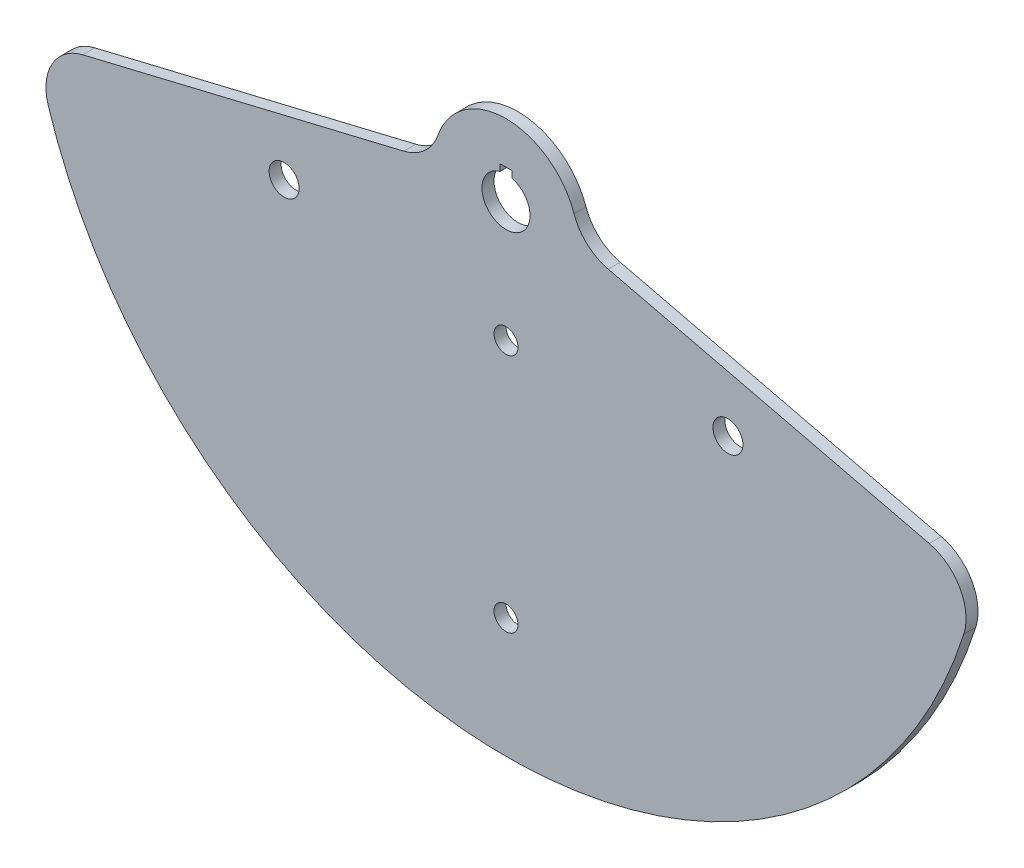
ISO-10303-21;
HEADER;
FILE_DESCRIPTION(('STEP AP214'),'2;1');
FILE_NAME('part.step','',(''),(''),'','','');
FILE_SCHEMA(('AUTOMOTIVE_DESIGN { 1 0 10303 214 1 1 1 1 }'));
ENDSEC;
DATA;
#1=APPLICATION_CONTEXT('core data for automotive mechanical design processes');
#2=APPLICATION_PROTOCOL_DEFINITION('international standard','automotive_design',2000,#1);
#3=PRODUCT_CONTEXT('',#1,'mechanical');
#4=PRODUCT('Part','Part','',(#3));
#5=PRODUCT_RELATED_PRODUCT_CATEGORY('part','',(#4));
#6=PRODUCT_DEFINITION_FORMATION('','',#4);
#7=PRODUCT_DEFINITION_CONTEXT('part definition',#1,'design');
#8=PRODUCT_DEFINITION('design','',#6,#7);
#9=PRODUCT_DEFINITION_SHAPE('','',#8);
#10=(LENGTH_UNIT() NAMED_UNIT(*) SI_UNIT(.MILLI.,.METRE.));
#11=(NAMED_UNIT(*) PLANE_ANGLE_UNIT() SI_UNIT($,.RADIAN.));
#12=(NAMED_UNIT(*) SI_UNIT($,.STERADIAN.) SOLID_ANGLE_UNIT());
#13=UNCERTAINTY_MEASURE_WITH_UNIT(LENGTH_MEASURE(1.E-05),#10,'distance_accuracy_value','');
#14=(GEOMETRIC_REPRESENTATION_CONTEXT(3) GLOBAL_UNCERTAINTY_ASSIGNED_CONTEXT((#13)) GLOBAL_UNIT_ASSIGNED_CONTEXT((#10,
#11,#12)) REPRESENTATION_CONTEXT('',''));
#15=CARTESIAN_POINT('',(0.,0.,0.));
#16=DIRECTION('',(0.,0.,1.));
#17=DIRECTION('',(1.,0.,0.));
#18=AXIS2_PLACEMENT_3D('',#15,#16,#17);
#19=CARTESIAN_POINT('',(59.9721936818723,20.8706968015925,3.175));
#20=DIRECTION('',(0.,0.,-1.));
#21=DIRECTION('',(-1.,0.,0.));
#22=AXIS2_PLACEMENT_3D('',#19,#20,#21);
#23=PLANE('',#22);
#24=CARTESIAN_POINT('',(0.,-190.5,3.175));
#25=DIRECTION('',(0.,0.,1.));
#26=DIRECTION('',(1.,0.,0.));
#27=AXIS2_PLACEMENT_3D('',#24,#25,#26);
#28=CIRCLE('',#27,6.35);
#29=CARTESIAN_POINT('',(6.35000000000002,-190.5,3.175));
#30=VERTEX_POINT('',#29);
#31=EDGE_CURVE('E391',#30,#30,#28,.T.);
#32=ORIENTED_EDGE('',*,*,#31,.F.);
#33=EDGE_LOOP('',(#32));
#34=FACE_BOUND('',#33,.T.);
#35=CARTESIAN_POINT('',(0.,-63.5,3.175));
#36=DIRECTION('',(0.,0.,1.));
#37=DIRECTION('',(1.,0.,0.));
#38=AXIS2_PLACEMENT_3D('',#35,#36,#37);
#39=CIRCLE('',#38,6.35);
#40=CARTESIAN_POINT('',(6.35000000000001,-63.5,3.175));
#41=VERTEX_POINT('',#40);
#42=EDGE_CURVE('E393',#41,#41,#39,.T.);
#43=ORIENTED_EDGE('',*,*,#42,.F.);
#44=EDGE_LOOP('',(#43));
#45=FACE_BOUND('',#44,.T.);
#46=DIRECTION('',(-1.,0.,0.));
#47=VECTOR('',#46,1.);
#48=CARTESIAN_POINT('',(3.175,15.875,3.175));
#49=LINE('',#48,#47);
#50=CARTESIAN_POINT('',(3.175,15.875,3.175));
#51=VERTEX_POINT('',#50);
#52=CARTESIAN_POINT('',(-3.175,15.875,3.175));
#53=VERTEX_POINT('',#52);
#54=EDGE_CURVE('E402',#51,#53,#49,.T.);
#55=ORIENTED_EDGE('',*,*,#54,.F.);
#56=DIRECTION('',(0.,1.,0.));
#57=VECTOR('',#56,1.);
#58=CARTESIAN_POINT('',(3.175,9.52500000000002,3.175));
#59=LINE('',#58,#57);
#60=CARTESIAN_POINT('',(3.175,12.2967221242086,3.175));
#61=VERTEX_POINT('',#60);
#62=EDGE_CURVE('E192',#61,#51,#59,.T.);
#63=ORIENTED_EDGE('',*,*,#62,.F.);
#64=CARTESIAN_POINT('',(0.,0.,3.175));
#65=DIRECTION('',(0.,0.,1.));
#66=DIRECTION('',(1.,0.,0.));
#67=AXIS2_PLACEMENT_3D('',#64,#65,#66);
#68=CIRCLE('',#67,12.7);
#69=CARTESIAN_POINT('',(-3.175,12.2967221242086,3.175));
#70=VERTEX_POINT('',#69);
#71=EDGE_CURVE('E150',#70,#61,#68,.T.);
#72=ORIENTED_EDGE('',*,*,#71,.F.);
#73=DIRECTION('',(0.,1.,0.));
#74=VECTOR('',#73,1.);
#75=CARTESIAN_POINT('',(-3.175,9.52500000000002,3.175));
#76=LINE('',#75,#74);
#77=EDGE_CURVE('E52',#70,#53,#76,.T.);
#78=ORIENTED_EDGE('',*,*,#77,.T.);
#79=EDGE_LOOP('',(#55,#63,#72,#78));
#80=FACE_BOUND('',#79,.T.);
#81=CARTESIAN_POINT('',(59.9721936818723,20.8706968015925,3.175));
#82=DIRECTION('',(0.,0.,-1.));
#83=DIRECTION('',(-1.,0.,0.));
#84=AXIS2_PLACEMENT_3D('',#81,#82,#83);
#85=CIRCLE('',#84,25.4);
#86=CARTESIAN_POINT('',(54.0426814399322,-3.82749917650851,3.175));
#87=VERTEX_POINT('',#86);
#88=CARTESIAN_POINT('',(35.9833162091234,12.5224180809555,3.175));
#89=VERTEX_POINT('',#88);
#90=EDGE_CURVE('E162',#87,#89,#85,.T.);
#91=ORIENTED_EDGE('',*,*,#90,.T.);
#92=CARTESIAN_POINT('',(0.,0.,3.175));
#93=DIRECTION('',(0.,0.,1.));
#94=DIRECTION('',(1.,0.,0.));
#95=AXIS2_PLACEMENT_3D('',#92,#93,#94);
#96=CIRCLE('',#95,38.1);
#97=CARTESIAN_POINT('',(-35.9833162091234,12.5224180809555,3.175));
#98=VERTEX_POINT('',#97);
#99=EDGE_CURVE('E103',#89,#98,#96,.T.);
#100=ORIENTED_EDGE('',*,*,#99,.T.);
#101=CARTESIAN_POINT('',(-59.9721936818723,20.8706968015924,3.175));
#102=DIRECTION('',(0.,0.,-1.));
#103=DIRECTION('',(1.,0.,0.));
#104=AXIS2_PLACEMENT_3D('',#101,#102,#103);
#105=CIRCLE('',#104,25.4);
#106=CARTESIAN_POINT('',(-54.0426814399322,-3.82749917650852,3.175));
#107=VERTEX_POINT('',#106);
#108=EDGE_CURVE('E202',#98,#107,#105,.T.);
#109=ORIENTED_EDGE('',*,*,#108,.T.);
#110=DIRECTION('',(-0.972369920397677,-0.233445363855906,0.));
#111=VECTOR('',#110,1.);
#112=CARTESIAN_POINT('',(-223.779910529454,-44.5778025060183,3.175));
#113=LINE('',#112,#111);
#114=CARTESIAN_POINT('',(-223.779910529454,-44.5778025060183,3.175));
#115=VERTEX_POINT('',#114);
#116=EDGE_CURVE('E204',#107,#115,#113,.T.);
#117=ORIENTED_EDGE('',*,*,#116,.T.);
#118=CARTESIAN_POINT('',(-217.850398287514,-69.2759984841193,3.175));
#119=DIRECTION('',(0.,0.,1.));
#120=DIRECTION('',(1.,0.,0.));
#121=AXIS2_PLACEMENT_3D('',#118,#119,#120);
#122=CIRCLE('',#121,25.4);
#123=CARTESIAN_POINT('',(-242.055998097237,-76.9733316490214,3.175));
#124=VERTEX_POINT('',#123);
#125=EDGE_CURVE('E125',#115,#124,#122,.T.);
#126=ORIENTED_EDGE('',*,*,#125,.T.);
#127=CARTESIAN_POINT('',(0.,0.,3.175));
#128=DIRECTION('',(0.,0.,1.));
#129=DIRECTION('',(1.,0.,0.));
#130=AXIS2_PLACEMENT_3D('',#127,#128,#129);
#131=CIRCLE('',#130,254.);
#132=CARTESIAN_POINT('',(242.055998097237,-76.9733316490214,3.175));
#133=VERTEX_POINT('',#132);
#134=EDGE_CURVE('E118',#124,#133,#131,.T.);
#135=ORIENTED_EDGE('',*,*,#134,.T.);
#136=CARTESIAN_POINT('',(217.850398287514,-69.2759984841192,3.175));
#137=DIRECTION('',(0.,0.,1.));
#138=DIRECTION('',(-1.,0.,0.));
#139=AXIS2_PLACEMENT_3D('',#136,#137,#138);
#140=CIRCLE('',#139,25.4);
#141=CARTESIAN_POINT('',(223.779910529454,-44.5778025060183,3.175));
#142=VERTEX_POINT('',#141);
#143=EDGE_CURVE('E122',#133,#142,#140,.T.);
#144=ORIENTED_EDGE('',*,*,#143,.T.);
#145=DIRECTION('',(-0.972369920397677,0.233445363855906,0.));
#146=VECTOR('',#145,1.);
#147=CARTESIAN_POINT('',(54.0426814399322,-3.82749917650851,3.175));
#148=LINE('',#147,#146);
#149=EDGE_CURVE('E61',#142,#87,#148,.T.);
#150=ORIENTED_EDGE('',*,*,#149,.T.);
#151=EDGE_LOOP('',(#91,#100,#109,#117,#126,#135,#144,#150));
#152=FACE_BOUND('',#151,.T.);
#153=CARTESIAN_POINT('',(-117.332700628933,-48.6007959103665,3.175));
#154=DIRECTION('',(0.,0.,1.));
#155=DIRECTION('',(1.,0.,0.));
#156=AXIS2_PLACEMENT_3D('',#153,#154,#155);
#157=CIRCLE('',#156,7.93749999999999);
#158=CARTESIAN_POINT('',(-109.395200628933,-48.6007959103665,3.175));
#159=VERTEX_POINT('',#158);
#160=EDGE_CURVE('E194',#159,#159,#157,.T.);
#161=ORIENTED_EDGE('',*,*,#160,.F.);
#162=EDGE_LOOP('',(#161));
#163=FACE_BOUND('',#162,.T.);
#164=CARTESIAN_POINT('',(117.332700628933,-48.6007959103665,3.175));
#165=DIRECTION('',(0.,0.,1.));
#166=DIRECTION('',(1.,0.,0.));
#167=AXIS2_PLACEMENT_3D('',#164,#165,#166);
#168=CIRCLE('',#167,7.93749999999998);
#169=CARTESIAN_POINT('',(125.270200628933,-48.6007959103665,3.175));
#170=VERTEX_POINT('',#169);
#171=EDGE_CURVE('E420',#170,#170,#168,.T.);
#172=ORIENTED_EDGE('',*,*,#171,.F.);
#173=EDGE_LOOP('',(#172));
#174=FACE_BOUND('',#173,.T.);
#175=ADVANCED_FACE('F37',(#34,#45,#80,#152,#163,#174),#23,.F.);
#176=CARTESIAN_POINT('',(59.9721936818723,20.8706968015925,-3.175));
#177=DIRECTION('',(0.,0.,-1.));
#178=DIRECTION('',(-1.,0.,0.));
#179=AXIS2_PLACEMENT_3D('',#176,#177,#178);
#180=PLANE('',#179);
#181=CARTESIAN_POINT('',(0.,-190.5,-3.175));
#182=DIRECTION('',(0.,0.,1.));
#183=DIRECTION('',(1.,0.,0.));
#184=AXIS2_PLACEMENT_3D('',#181,#182,#183);
#185=CIRCLE('',#184,6.35);
#186=CARTESIAN_POINT('',(6.35000000000002,-190.5,-3.175));
#187=VERTEX_POINT('',#186);
#188=EDGE_CURVE('E389',#187,#187,#185,.T.);
#189=ORIENTED_EDGE('',*,*,#188,.T.);
#190=EDGE_LOOP('',(#189));
#191=FACE_BOUND('',#190,.T.);
#192=CARTESIAN_POINT('',(0.,-63.5,-3.175));
#193=DIRECTION('',(0.,0.,1.));
#194=DIRECTION('',(1.,0.,0.));
#195=AXIS2_PLACEMENT_3D('',#192,#193,#194);
#196=CIRCLE('',#195,6.35);
#197=CARTESIAN_POINT('',(6.35000000000001,-63.5,-3.175));
#198=VERTEX_POINT('',#197);
#199=EDGE_CURVE('E398',#198,#198,#196,.T.);
#200=ORIENTED_EDGE('',*,*,#199,.T.);
#201=EDGE_LOOP('',(#200));
#202=FACE_BOUND('',#201,.T.);
#203=DIRECTION('',(0.,1.,0.));
#204=VECTOR('',#203,1.);
#205=CARTESIAN_POINT('',(3.175,9.52500000000002,-3.175));
#206=LINE('',#205,#204);
#207=CARTESIAN_POINT('',(3.175,12.2967221242086,-3.175));
#208=VERTEX_POINT('',#207);
#209=CARTESIAN_POINT('',(3.175,15.875,-3.175));
#210=VERTEX_POINT('',#209);
#211=EDGE_CURVE('E406',#208,#210,#206,.T.);
#212=ORIENTED_EDGE('',*,*,#211,.T.);
#213=DIRECTION('',(-1.,0.,0.));
#214=VECTOR('',#213,1.);
#215=CARTESIAN_POINT('',(3.175,15.875,-3.175));
#216=LINE('',#215,#214);
#217=CARTESIAN_POINT('',(-3.175,15.875,-3.175));
#218=VERTEX_POINT('',#217);
#219=EDGE_CURVE('E409',#210,#218,#216,.T.);
#220=ORIENTED_EDGE('',*,*,#219,.T.);
#221=DIRECTION('',(0.,1.,0.));
#222=VECTOR('',#221,1.);
#223=CARTESIAN_POINT('',(-3.175,9.52500000000002,-3.175));
#224=LINE('',#223,#222);
#225=CARTESIAN_POINT('',(-3.175,12.2967221242086,-3.175));
#226=VERTEX_POINT('',#225);
#227=EDGE_CURVE('E412',#226,#218,#224,.T.);
#228=ORIENTED_EDGE('',*,*,#227,.F.);
#229=CARTESIAN_POINT('',(0.,0.,-3.175));
#230=DIRECTION('',(0.,0.,1.));
#231=DIRECTION('',(1.,0.,0.));
#232=AXIS2_PLACEMENT_3D('',#229,#230,#231);
#233=CIRCLE('',#232,12.7);
#234=EDGE_CURVE('E184',#226,#208,#233,.T.);
#235=ORIENTED_EDGE('',*,*,#234,.T.);
#236=EDGE_LOOP('',(#212,#220,#228,#235));
#237=FACE_BOUND('',#236,.T.);
#238=CARTESIAN_POINT('',(-117.332700628933,-48.6007959103665,-3.175));
#239=DIRECTION('',(0.,0.,1.));
#240=DIRECTION('',(1.,0.,0.));
#241=AXIS2_PLACEMENT_3D('',#238,#239,#240);
#242=CIRCLE('',#241,7.93749999999999);
#243=CARTESIAN_POINT('',(-109.395200628933,-48.6007959103665,-3.175));
#244=VERTEX_POINT('',#243);
#245=EDGE_CURVE('E197',#244,#244,#242,.T.);
#246=ORIENTED_EDGE('',*,*,#245,.T.);
#247=EDGE_LOOP('',(#246));
#248=FACE_BOUND('',#247,.T.);
#249=CARTESIAN_POINT('',(59.9721936818723,20.8706968015925,-3.175));
#250=DIRECTION('',(0.,0.,-1.));
#251=DIRECTION('',(-1.,0.,0.));
#252=AXIS2_PLACEMENT_3D('',#249,#250,#251);
#253=CIRCLE('',#252,25.4);
#254=CARTESIAN_POINT('',(54.0426814399322,-3.82749917650851,-3.175));
#255=VERTEX_POINT('',#254);
#256=CARTESIAN_POINT('',(35.9833162091234,12.5224180809555,-3.175));
#257=VERTEX_POINT('',#256);
#258=EDGE_CURVE('E146',#255,#257,#253,.T.);
#259=ORIENTED_EDGE('',*,*,#258,.F.);
#260=DIRECTION('',(-0.972369920397677,0.233445363855906,0.));
#261=VECTOR('',#260,1.);
#262=CARTESIAN_POINT('',(54.0426814399322,-3.82749917650851,-3.175));
#263=LINE('',#262,#261);
#264=CARTESIAN_POINT('',(223.779910529454,-44.5778025060183,-3.175));
#265=VERTEX_POINT('',#264);
#266=EDGE_CURVE('E94',#265,#255,#263,.T.);
#267=ORIENTED_EDGE('',*,*,#266,.F.);
#268=CARTESIAN_POINT('',(217.850398287514,-69.2759984841192,-3.175));
#269=DIRECTION('',(0.,0.,1.));
#270=DIRECTION('',(-1.,0.,0.));
#271=AXIS2_PLACEMENT_3D('',#268,#269,#270);
#272=CIRCLE('',#271,25.4);
#273=CARTESIAN_POINT('',(242.055998097237,-76.9733316490214,-3.175));
#274=VERTEX_POINT('',#273);
#275=EDGE_CURVE('E159',#274,#265,#272,.T.);
#276=ORIENTED_EDGE('',*,*,#275,.F.);
#277=CARTESIAN_POINT('',(0.,0.,-3.175));
#278=DIRECTION('',(0.,0.,1.));
#279=DIRECTION('',(1.,0.,0.));
#280=AXIS2_PLACEMENT_3D('',#277,#278,#279);
#281=CIRCLE('',#280,254.);
#282=CARTESIAN_POINT('',(-242.055998097237,-76.9733316490214,-3.175));
#283=VERTEX_POINT('',#282);
#284=EDGE_CURVE('E134',#283,#274,#281,.T.);
#285=ORIENTED_EDGE('',*,*,#284,.F.);
#286=CARTESIAN_POINT('',(-217.850398287514,-69.2759984841193,-3.175));
#287=DIRECTION('',(0.,0.,1.));
#288=DIRECTION('',(1.,0.,0.));
#289=AXIS2_PLACEMENT_3D('',#286,#287,#288);
#290=CIRCLE('',#289,25.4);
#291=CARTESIAN_POINT('',(-223.779910529454,-44.5778025060183,-3.175));
#292=VERTEX_POINT('',#291);
#293=EDGE_CURVE('E156',#292,#283,#290,.T.);
#294=ORIENTED_EDGE('',*,*,#293,.F.);
#295=DIRECTION('',(-0.972369920397677,-0.233445363855906,0.));
#296=VECTOR('',#295,1.);
#297=CARTESIAN_POINT('',(-223.779910529454,-44.5778025060183,-3.175));
#298=LINE('',#297,#296);
#299=CARTESIAN_POINT('',(-54.0426814399322,-3.82749917650852,-3.175));
#300=VERTEX_POINT('',#299);
#301=EDGE_CURVE('E154',#300,#292,#298,.T.);
#302=ORIENTED_EDGE('',*,*,#301,.F.);
#303=CARTESIAN_POINT('',(-59.9721936818723,20.8706968015924,-3.175));
#304=DIRECTION('',(0.,0.,-1.));
#305=DIRECTION('',(1.,0.,0.));
#306=AXIS2_PLACEMENT_3D('',#303,#304,#305);
#307=CIRCLE('',#306,25.4);
#308=CARTESIAN_POINT('',(-35.9833162091234,12.5224180809555,-3.175));
#309=VERTEX_POINT('',#308);
#310=EDGE_CURVE('E152',#309,#300,#307,.T.);
#311=ORIENTED_EDGE('',*,*,#310,.F.);
#312=CARTESIAN_POINT('',(0.,0.,-3.175));
#313=DIRECTION('',(0.,0.,1.));
#314=DIRECTION('',(1.,0.,0.));
#315=AXIS2_PLACEMENT_3D('',#312,#313,#314);
#316=CIRCLE('',#315,38.1);
#317=EDGE_CURVE('E149',#257,#309,#316,.T.);
#318=ORIENTED_EDGE('',*,*,#317,.F.);
#319=EDGE_LOOP('',(#259,#267,#276,#285,#294,#302,#311,#318));
#320=FACE_BOUND('',#319,.T.);
#321=CARTESIAN_POINT('',(117.332700628933,-48.6007959103665,-3.175));
#322=DIRECTION('',(0.,0.,1.));
#323=DIRECTION('',(1.,0.,0.));
#324=AXIS2_PLACEMENT_3D('',#321,#322,#323);
#325=CIRCLE('',#324,7.93749999999998);
#326=CARTESIAN_POINT('',(125.270200628933,-48.6007959103665,-3.175));
#327=VERTEX_POINT('',#326);
#328=EDGE_CURVE('E417',#327,#327,#325,.T.);
#329=ORIENTED_EDGE('',*,*,#328,.T.);
#330=EDGE_LOOP('',(#329));
#331=FACE_BOUND('',#330,.T.);
#332=ADVANCED_FACE('F217',(#191,#202,#237,#248,#320,#331),#180,.T.);
#333=CARTESIAN_POINT('',(59.9721936818723,20.8706968015925,3.175));
#334=DIRECTION('',(0.,0.,-1.));
#335=DIRECTION('',(-1.,0.,0.));
#336=AXIS2_PLACEMENT_3D('',#333,#334,#335);
#337=CYLINDRICAL_SURFACE('',#336,25.4);
#338=ORIENTED_EDGE('',*,*,#258,.T.);
#339=DIRECTION('',(0.,0.,-1.));
#340=VECTOR('',#339,1.);
#341=CARTESIAN_POINT('',(35.9833162091234,12.5224180809555,3.175));
#342=LINE('',#341,#340);
#343=EDGE_CURVE('E175',#89,#257,#342,.T.);
#344=ORIENTED_EDGE('',*,*,#343,.F.);
#345=ORIENTED_EDGE('',*,*,#90,.F.);
#346=DIRECTION('',(0.,0.,-1.));
#347=VECTOR('',#346,1.);
#348=CARTESIAN_POINT('',(54.0426814399322,-3.82749917650851,3.175));
#349=LINE('',#348,#347);
#350=EDGE_CURVE('E142',#87,#255,#349,.T.);
#351=ORIENTED_EDGE('',*,*,#350,.T.);
#352=EDGE_LOOP('',(#338,#344,#345,#351));
#353=FACE_BOUND('',#352,.T.);
#354=ADVANCED_FACE('F39',(#353),#337,.F.);
#355=CARTESIAN_POINT('',(0.,0.,3.175));
#356=DIRECTION('',(0.,0.,-1.));
#357=DIRECTION('',(-1.,0.,0.));
#358=AXIS2_PLACEMENT_3D('',#355,#356,#357);
#359=CYLINDRICAL_SURFACE('',#358,38.1);
#360=ORIENTED_EDGE('',*,*,#317,.T.);
#361=DIRECTION('',(0.,0.,-1.));
#362=VECTOR('',#361,1.);
#363=CARTESIAN_POINT('',(-35.9833162091234,12.5224180809555,3.175));
#364=LINE('',#363,#362);
#365=EDGE_CURVE('E172',#98,#309,#364,.T.);
#366=ORIENTED_EDGE('',*,*,#365,.F.);
#367=ORIENTED_EDGE('',*,*,#99,.F.);
#368=ORIENTED_EDGE('',*,*,#343,.T.);
#369=EDGE_LOOP('',(#360,#366,#367,#368));
#370=FACE_BOUND('',#369,.T.);
#371=ADVANCED_FACE('F223',(#370),#359,.T.);
#372=CARTESIAN_POINT('',(-59.9721936818723,20.8706968015924,3.175));
#373=DIRECTION('',(0.,0.,-1.));
#374=DIRECTION('',(-1.,0.,0.));
#375=AXIS2_PLACEMENT_3D('',#372,#373,#374);
#376=CYLINDRICAL_SURFACE('',#375,25.4);
#377=ORIENTED_EDGE('',*,*,#310,.T.);
#378=DIRECTION('',(0.,0.,-1.));
#379=VECTOR('',#378,1.);
#380=CARTESIAN_POINT('',(-54.0426814399322,-3.82749917650852,3.175));
#381=LINE('',#380,#379);
#382=EDGE_CURVE('E169',#107,#300,#381,.T.);
#383=ORIENTED_EDGE('',*,*,#382,.F.);
#384=ORIENTED_EDGE('',*,*,#108,.F.);
#385=ORIENTED_EDGE('',*,*,#365,.T.);
#386=EDGE_LOOP('',(#377,#383,#384,#385));
#387=FACE_BOUND('',#386,.T.);
#388=ADVANCED_FACE('F226',(#387),#376,.F.);
#389=CARTESIAN_POINT('',(-223.779910529454,-44.5778025060183,3.175));
#390=DIRECTION('',(0.233445363855906,-0.972369920397676,0.));
#391=DIRECTION('',(0.972369920397676,0.233445363855906,0.));
#392=AXIS2_PLACEMENT_3D('',#389,#390,#391);
#393=PLANE('',#392);
#394=ORIENTED_EDGE('',*,*,#301,.T.);
#395=DIRECTION('',(0.,0.,-1.));
#396=VECTOR('',#395,1.);
#397=CARTESIAN_POINT('',(-223.779910529454,-44.5778025060183,3.175));
#398=LINE('',#397,#396);
#399=EDGE_CURVE('E166',#115,#292,#398,.T.);
#400=ORIENTED_EDGE('',*,*,#399,.F.);
#401=ORIENTED_EDGE('',*,*,#116,.F.);
#402=ORIENTED_EDGE('',*,*,#382,.T.);
#403=EDGE_LOOP('',(#394,#400,#401,#402));
#404=FACE_BOUND('',#403,.T.);
#405=ADVANCED_FACE('F210',(#404),#393,.F.);
#406=CARTESIAN_POINT('',(-217.850398287514,-69.2759984841193,3.175));
#407=DIRECTION('',(0.,0.,-1.));
#408=DIRECTION('',(-1.,0.,0.));
#409=AXIS2_PLACEMENT_3D('',#406,#407,#408);
#410=CYLINDRICAL_SURFACE('',#409,25.4);
#411=ORIENTED_EDGE('',*,*,#293,.T.);
#412=DIRECTION('',(0.,0.,-1.));
#413=VECTOR('',#412,1.);
#414=CARTESIAN_POINT('',(-242.055998097237,-76.9733316490214,3.175));
#415=LINE('',#414,#413);
#416=EDGE_CURVE('E137',#124,#283,#415,.T.);
#417=ORIENTED_EDGE('',*,*,#416,.F.);
#418=ORIENTED_EDGE('',*,*,#125,.F.);
#419=ORIENTED_EDGE('',*,*,#399,.T.);
#420=EDGE_LOOP('',(#411,#417,#418,#419));
#421=FACE_BOUND('',#420,.T.);
#422=ADVANCED_FACE('F214',(#421),#410,.T.);
#423=CARTESIAN_POINT('',(0.,0.,3.175));
#424=DIRECTION('',(0.,0.,-1.));
#425=DIRECTION('',(-1.,0.,0.));
#426=AXIS2_PLACEMENT_3D('',#423,#424,#425);
#427=CYLINDRICAL_SURFACE('',#426,254.);
#428=ORIENTED_EDGE('',*,*,#284,.T.);
#429=DIRECTION('',(0.,0.,-1.));
#430=VECTOR('',#429,1.);
#431=CARTESIAN_POINT('',(242.055998097237,-76.9733316490214,3.175));
#432=LINE('',#431,#430);
#433=EDGE_CURVE('E131',#133,#274,#432,.T.);
#434=ORIENTED_EDGE('',*,*,#433,.F.);
#435=ORIENTED_EDGE('',*,*,#134,.F.);
#436=ORIENTED_EDGE('',*,*,#416,.T.);
#437=EDGE_LOOP('',(#428,#434,#435,#436));
#438=FACE_BOUND('',#437,.T.);
#439=ADVANCED_FACE('F132',(#438),#427,.T.);
#440=CARTESIAN_POINT('',(217.850398287514,-69.2759984841192,3.175));
#441=DIRECTION('',(0.,0.,-1.));
#442=DIRECTION('',(-1.,0.,0.));
#443=AXIS2_PLACEMENT_3D('',#440,#441,#442);
#444=CYLINDRICAL_SURFACE('',#443,25.4);
#445=ORIENTED_EDGE('',*,*,#275,.T.);
#446=DIRECTION('',(0.,0.,-1.));
#447=VECTOR('',#446,1.);
#448=CARTESIAN_POINT('',(223.779910529454,-44.5778025060183,3.175));
#449=LINE('',#448,#447);
#450=EDGE_CURVE('E138',#142,#265,#449,.T.);
#451=ORIENTED_EDGE('',*,*,#450,.F.);
#452=ORIENTED_EDGE('',*,*,#143,.F.);
#453=ORIENTED_EDGE('',*,*,#433,.T.);
#454=EDGE_LOOP('',(#445,#451,#452,#453));
#455=FACE_BOUND('',#454,.T.);
#456=ADVANCED_FACE('F140',(#455),#444,.T.);
#457=CARTESIAN_POINT('',(54.0426814399322,-3.82749917650851,3.175));
#458=DIRECTION('',(-0.233445363855906,-0.972369920397676,0.));
#459=DIRECTION('',(0.972369920397676,-0.233445363855906,0.));
#460=AXIS2_PLACEMENT_3D('',#457,#458,#459);
#461=PLANE('',#460);
#462=ORIENTED_EDGE('',*,*,#266,.T.);
#463=ORIENTED_EDGE('',*,*,#350,.F.);
#464=ORIENTED_EDGE('',*,*,#149,.F.);
#465=ORIENTED_EDGE('',*,*,#450,.T.);
#466=EDGE_LOOP('',(#462,#463,#464,#465));
#467=FACE_BOUND('',#466,.T.);
#468=ADVANCED_FACE('F219',(#467),#461,.F.);
#469=CARTESIAN_POINT('',(0.,0.,3.175));
#470=DIRECTION('',(0.,0.,-1.));
#471=DIRECTION('',(-1.,0.,0.));
#472=AXIS2_PLACEMENT_3D('',#469,#470,#471);
#473=CYLINDRICAL_SURFACE('',#472,12.7);
#474=DIRECTION('',(0.,0.,-1.));
#475=VECTOR('',#474,1.);
#476=CARTESIAN_POINT('',(3.175,12.2967221242086,3.175));
#477=LINE('',#476,#475);
#478=EDGE_CURVE('E11',#208,#61,#477,.F.);
#479=ORIENTED_EDGE('',*,*,#478,.F.);
#480=ORIENTED_EDGE('',*,*,#234,.F.);
#481=DIRECTION('',(0.,0.,-1.));
#482=VECTOR('',#481,1.);
#483=CARTESIAN_POINT('',(-3.175,12.2967221242086,3.175));
#484=LINE('',#483,#482);
#485=EDGE_CURVE('E45',#226,#70,#484,.F.);
#486=ORIENTED_EDGE('',*,*,#485,.T.);
#487=ORIENTED_EDGE('',*,*,#71,.T.);
#488=EDGE_LOOP('',(#479,#480,#486,#487));
#489=FACE_BOUND('',#488,.T.);
#490=ADVANCED_FACE('F181',(#489),#473,.F.);
#491=CARTESIAN_POINT('',(-117.332700628933,-48.6007959103665,3.175));
#492=DIRECTION('',(0.,0.,-1.));
#493=DIRECTION('',(-1.,0.,0.));
#494=AXIS2_PLACEMENT_3D('',#491,#492,#493);
#495=CYLINDRICAL_SURFACE('',#494,7.93749999999999);
#496=ORIENTED_EDGE('',*,*,#160,.T.);
#497=EDGE_LOOP('',(#496));
#498=FACE_BOUND('',#497,.T.);
#499=ORIENTED_EDGE('',*,*,#245,.F.);
#500=EDGE_LOOP('',(#499));
#501=FACE_BOUND('',#500,.T.);
#502=ADVANCED_FACE('F277',(#498,#501),#495,.F.);
#503=CARTESIAN_POINT('',(117.332700628933,-48.6007959103665,3.175));
#504=DIRECTION('',(0.,0.,-1.));
#505=DIRECTION('',(-1.,0.,0.));
#506=AXIS2_PLACEMENT_3D('',#503,#504,#505);
#507=CYLINDRICAL_SURFACE('',#506,7.93749999999998);
#508=ORIENTED_EDGE('',*,*,#171,.T.);
#509=EDGE_LOOP('',(#508));
#510=FACE_BOUND('',#509,.T.);
#511=ORIENTED_EDGE('',*,*,#328,.F.);
#512=EDGE_LOOP('',(#511));
#513=FACE_BOUND('',#512,.T.);
#514=ADVANCED_FACE('F284',(#510,#513),#507,.F.);
#515=CARTESIAN_POINT('',(3.175,9.52500000000002,-3.175));
#516=DIRECTION('',(1.,0.,0.));
#517=DIRECTION('',(0.,0.,-1.));
#518=AXIS2_PLACEMENT_3D('',#515,#516,#517);
#519=PLANE('',#518);
#520=ORIENTED_EDGE('',*,*,#478,.T.);
#521=ORIENTED_EDGE('',*,*,#62,.T.);
#522=DIRECTION('',(0.,0.,1.));
#523=VECTOR('',#522,1.);
#524=CARTESIAN_POINT('',(3.175,15.875,-3.175));
#525=LINE('',#524,#523);
#526=EDGE_CURVE('E414',#210,#51,#525,.T.);
#527=ORIENTED_EDGE('',*,*,#526,.F.);
#528=ORIENTED_EDGE('',*,*,#211,.F.);
#529=EDGE_LOOP('',(#520,#521,#527,#528));
#530=FACE_BOUND('',#529,.T.);
#531=ADVANCED_FACE('F290',(#530),#519,.F.);
#532=CARTESIAN_POINT('',(-3.175,9.52500000000002,-3.175));
#533=DIRECTION('',(1.,0.,0.));
#534=DIRECTION('',(0.,0.,-1.));
#535=AXIS2_PLACEMENT_3D('',#532,#533,#534);
#536=PLANE('',#535);
#537=ORIENTED_EDGE('',*,*,#227,.T.);
#538=DIRECTION('',(0.,0.,1.));
#539=VECTOR('',#538,1.);
#540=CARTESIAN_POINT('',(-3.175,15.875,-3.175));
#541=LINE('',#540,#539);
#542=EDGE_CURVE('E415',#218,#53,#541,.T.);
#543=ORIENTED_EDGE('',*,*,#542,.T.);
#544=ORIENTED_EDGE('',*,*,#77,.F.);
#545=ORIENTED_EDGE('',*,*,#485,.F.);
#546=EDGE_LOOP('',(#537,#543,#544,#545));
#547=FACE_BOUND('',#546,.T.);
#548=ADVANCED_FACE('F297',(#547),#536,.T.);
#549=CARTESIAN_POINT('',(3.175,15.875,-3.175));
#550=DIRECTION('',(0.,1.,0.));
#551=DIRECTION('',(0.,0.,1.));
#552=AXIS2_PLACEMENT_3D('',#549,#550,#551);
#553=PLANE('',#552);
#554=ORIENTED_EDGE('',*,*,#542,.F.);
#555=ORIENTED_EDGE('',*,*,#219,.F.);
#556=ORIENTED_EDGE('',*,*,#526,.T.);
#557=ORIENTED_EDGE('',*,*,#54,.T.);
#558=EDGE_LOOP('',(#554,#555,#556,#557));
#559=FACE_BOUND('',#558,.T.);
#560=ADVANCED_FACE('F305',(#559),#553,.F.);
#561=CARTESIAN_POINT('',(0.,-63.5,-3.175));
#562=DIRECTION('',(0.,0.,1.));
#563=DIRECTION('',(1.,0.,0.));
#564=AXIS2_PLACEMENT_3D('',#561,#562,#563);
#565=CYLINDRICAL_SURFACE('',#564,6.35);
#566=ORIENTED_EDGE('',*,*,#199,.F.);
#567=EDGE_LOOP('',(#566));
#568=FACE_BOUND('',#567,.T.);
#569=ORIENTED_EDGE('',*,*,#42,.T.);
#570=EDGE_LOOP('',(#569));
#571=FACE_BOUND('',#570,.T.);
#572=ADVANCED_FACE('F312',(#568,#571),#565,.F.);
#573=CARTESIAN_POINT('',(0.,-190.5,-3.175));
#574=DIRECTION('',(0.,0.,1.));
#575=DIRECTION('',(1.,0.,0.));
#576=AXIS2_PLACEMENT_3D('',#573,#574,#575);
#577=CYLINDRICAL_SURFACE('',#576,6.35);
#578=ORIENTED_EDGE('',*,*,#188,.F.);
#579=EDGE_LOOP('',(#578));
#580=FACE_BOUND('',#579,.T.);
#581=ORIENTED_EDGE('',*,*,#31,.T.);
#582=EDGE_LOOP('',(#581));
#583=FACE_BOUND('',#582,.T.);
#584=ADVANCED_FACE('F320',(#580,#583),#577,.F.);
#585=CLOSED_SHELL('',(#175,#332,#354,#371,#388,#405,#422,#439,#456,#468,#490,#502,#514,#531,
#548,#560,#572,#584));
#586=MANIFOLD_SOLID_BREP('B2',#585);
#587=ADVANCED_BREP_SHAPE_REPRESENTATION('',(#18,#586),#14);
#588=SHAPE_DEFINITION_REPRESENTATION(#9,#587);
ENDSEC;
END-ISO-10303-21;
